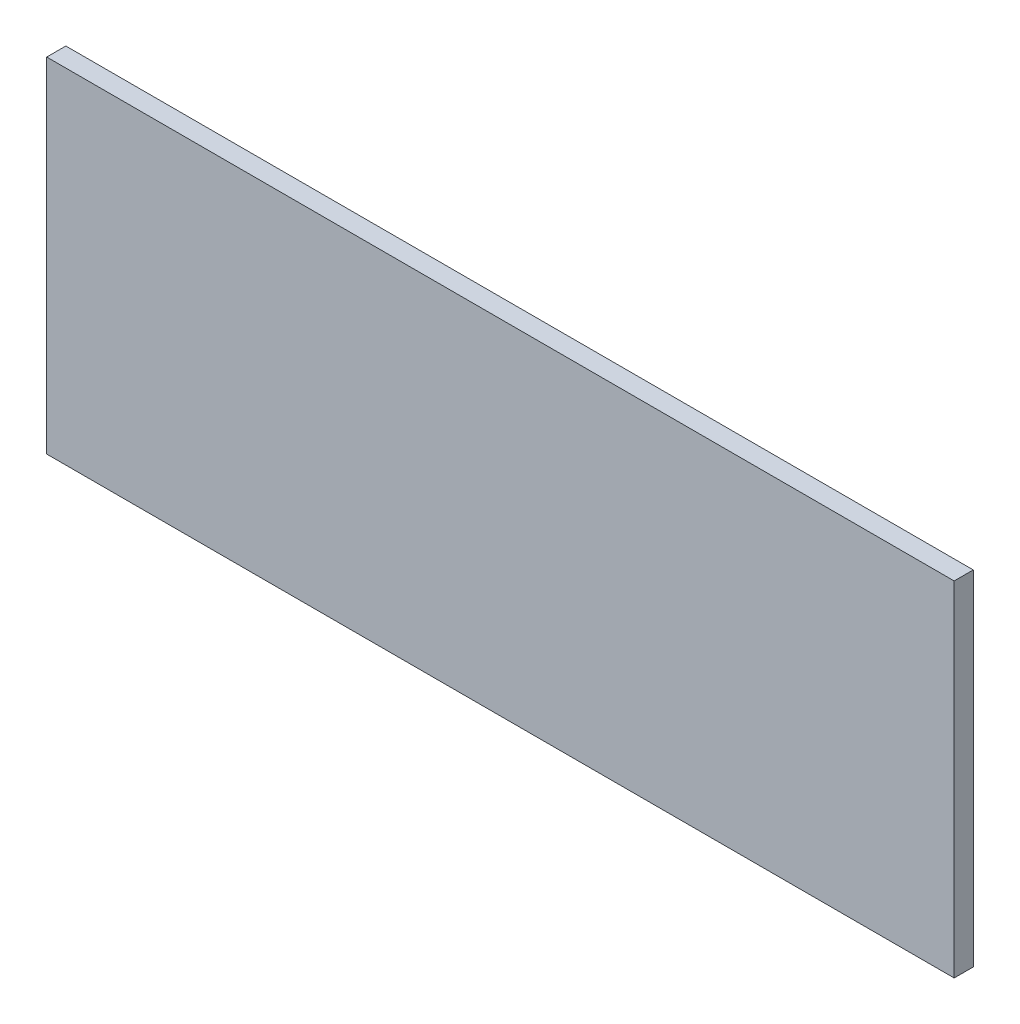
ISO-10303-21;
HEADER;
FILE_DESCRIPTION(('STEP AP214'),'2;1');
FILE_NAME('part.step','',(''),(''),'','','');
FILE_SCHEMA(('AUTOMOTIVE_DESIGN { 1 0 10303 214 1 1 1 1 }'));
ENDSEC;
DATA;
#1=APPLICATION_CONTEXT('core data for automotive mechanical design processes');
#2=APPLICATION_PROTOCOL_DEFINITION('international standard','automotive_design',2000,#1);
#3=PRODUCT_CONTEXT('',#1,'mechanical');
#4=PRODUCT('Part','Part','',(#3));
#5=PRODUCT_RELATED_PRODUCT_CATEGORY('part','',(#4));
#6=PRODUCT_DEFINITION_FORMATION('','',#4);
#7=PRODUCT_DEFINITION_CONTEXT('part definition',#1,'design');
#8=PRODUCT_DEFINITION('design','',#6,#7);
#9=PRODUCT_DEFINITION_SHAPE('','',#8);
#10=(LENGTH_UNIT() NAMED_UNIT(*) SI_UNIT(.MILLI.,.METRE.));
#11=(NAMED_UNIT(*) PLANE_ANGLE_UNIT() SI_UNIT($,.RADIAN.));
#12=(NAMED_UNIT(*) SI_UNIT($,.STERADIAN.) SOLID_ANGLE_UNIT());
#13=UNCERTAINTY_MEASURE_WITH_UNIT(LENGTH_MEASURE(1.E-05),#10,'distance_accuracy_value','');
#14=(GEOMETRIC_REPRESENTATION_CONTEXT(3) GLOBAL_UNCERTAINTY_ASSIGNED_CONTEXT((#13)) GLOBAL_UNIT_ASSIGNED_CONTEXT((#10,
#11,#12)) REPRESENTATION_CONTEXT('',''));
#15=CARTESIAN_POINT('',(0.,0.,0.));
#16=DIRECTION('',(0.,0.,1.));
#17=DIRECTION('',(1.,0.,0.));
#18=AXIS2_PLACEMENT_3D('',#15,#16,#17);
#19=CARTESIAN_POINT('',(-237.5,90.,10.));
#20=DIRECTION('',(1.,0.,0.));
#21=DIRECTION('',(0.,1.,0.));
#22=AXIS2_PLACEMENT_3D('',#19,#20,#21);
#23=PLANE('',#22);
#24=DIRECTION('',(0.,-1.,0.));
#25=VECTOR('',#24,1.);
#26=CARTESIAN_POINT('',(-237.5,90.,0.));
#27=LINE('',#26,#25);
#28=CARTESIAN_POINT('',(-237.5,90.,0.));
#29=VERTEX_POINT('',#28);
#30=CARTESIAN_POINT('',(-237.5,-90.,0.));
#31=VERTEX_POINT('',#30);
#32=EDGE_CURVE('E96',#29,#31,#27,.T.);
#33=ORIENTED_EDGE('',*,*,#32,.T.);
#34=DIRECTION('',(0.,0.,-1.));
#35=VECTOR('',#34,1.);
#36=CARTESIAN_POINT('',(-237.5,-90.,10.));
#37=LINE('',#36,#35);
#38=CARTESIAN_POINT('',(-237.5,-90.,10.));
#39=VERTEX_POINT('',#38);
#40=EDGE_CURVE('E11',#39,#31,#37,.T.);
#41=ORIENTED_EDGE('',*,*,#40,.F.);
#42=DIRECTION('',(0.,-1.,0.));
#43=VECTOR('',#42,1.);
#44=CARTESIAN_POINT('',(-237.5,90.,10.));
#45=LINE('',#44,#43);
#46=CARTESIAN_POINT('',(-237.5,90.,10.));
#47=VERTEX_POINT('',#46);
#48=EDGE_CURVE('E84',#47,#39,#45,.T.);
#49=ORIENTED_EDGE('',*,*,#48,.F.);
#50=DIRECTION('',(0.,0.,-1.));
#51=VECTOR('',#50,1.);
#52=CARTESIAN_POINT('',(-237.5,90.,10.));
#53=LINE('',#52,#51);
#54=EDGE_CURVE('E92',#47,#29,#53,.T.);
#55=ORIENTED_EDGE('',*,*,#54,.T.);
#56=EDGE_LOOP('',(#33,#41,#49,#55));
#57=FACE_BOUND('',#56,.T.);
#58=ADVANCED_FACE('F33',(#57),#23,.F.);
#59=CARTESIAN_POINT('',(237.5,-90.,10.));
#60=DIRECTION('',(0.,1.,0.));
#61=DIRECTION('',(-1.,0.,0.));
#62=AXIS2_PLACEMENT_3D('',#59,#60,#61);
#63=PLANE('',#62);
#64=DIRECTION('',(1.,0.,0.));
#65=VECTOR('',#64,1.);
#66=CARTESIAN_POINT('',(237.5,-90.,0.));
#67=LINE('',#66,#65);
#68=CARTESIAN_POINT('',(237.5,-90.,0.));
#69=VERTEX_POINT('',#68);
#70=EDGE_CURVE('E88',#31,#69,#67,.T.);
#71=ORIENTED_EDGE('',*,*,#70,.T.);
#72=DIRECTION('',(0.,0.,-1.));
#73=VECTOR('',#72,1.);
#74=CARTESIAN_POINT('',(237.5,-90.,10.));
#75=LINE('',#74,#73);
#76=CARTESIAN_POINT('',(237.5,-90.,10.));
#77=VERTEX_POINT('',#76);
#78=EDGE_CURVE('E41',#77,#69,#75,.T.);
#79=ORIENTED_EDGE('',*,*,#78,.F.);
#80=DIRECTION('',(1.,0.,0.));
#81=VECTOR('',#80,1.);
#82=CARTESIAN_POINT('',(237.5,-90.,10.));
#83=LINE('',#82,#81);
#84=EDGE_CURVE('E79',#39,#77,#83,.T.);
#85=ORIENTED_EDGE('',*,*,#84,.F.);
#86=ORIENTED_EDGE('',*,*,#40,.T.);
#87=EDGE_LOOP('',(#71,#79,#85,#86));
#88=FACE_BOUND('',#87,.T.);
#89=ADVANCED_FACE('F87',(#88),#63,.F.);
#90=CARTESIAN_POINT('',(237.5,90.,10.));
#91=DIRECTION('',(-1.,0.,0.));
#92=DIRECTION('',(0.,-1.,0.));
#93=AXIS2_PLACEMENT_3D('',#90,#91,#92);
#94=PLANE('',#93);
#95=DIRECTION('',(0.,1.,0.));
#96=VECTOR('',#95,1.);
#97=CARTESIAN_POINT('',(237.5,90.,0.));
#98=LINE('',#97,#96);
#99=CARTESIAN_POINT('',(237.5,90.,0.));
#100=VERTEX_POINT('',#99);
#101=EDGE_CURVE('E66',#69,#100,#98,.T.);
#102=ORIENTED_EDGE('',*,*,#101,.T.);
#103=DIRECTION('',(0.,0.,-1.));
#104=VECTOR('',#103,1.);
#105=CARTESIAN_POINT('',(237.5,90.,10.));
#106=LINE('',#105,#104);
#107=CARTESIAN_POINT('',(237.5,90.,10.));
#108=VERTEX_POINT('',#107);
#109=EDGE_CURVE('E89',#108,#100,#106,.T.);
#110=ORIENTED_EDGE('',*,*,#109,.F.);
#111=DIRECTION('',(0.,1.,0.));
#112=VECTOR('',#111,1.);
#113=CARTESIAN_POINT('',(237.5,90.,10.));
#114=LINE('',#113,#112);
#115=EDGE_CURVE('E82',#77,#108,#114,.T.);
#116=ORIENTED_EDGE('',*,*,#115,.F.);
#117=ORIENTED_EDGE('',*,*,#78,.T.);
#118=EDGE_LOOP('',(#102,#110,#116,#117));
#119=FACE_BOUND('',#118,.T.);
#120=ADVANCED_FACE('F90',(#119),#94,.F.);
#121=CARTESIAN_POINT('',(237.5,90.,10.));
#122=DIRECTION('',(0.,-1.,0.));
#123=DIRECTION('',(1.,0.,0.));
#124=AXIS2_PLACEMENT_3D('',#121,#122,#123);
#125=PLANE('',#124);
#126=DIRECTION('',(-1.,0.,0.));
#127=VECTOR('',#126,1.);
#128=CARTESIAN_POINT('',(237.5,90.,0.));
#129=LINE('',#128,#127);
#130=EDGE_CURVE('E72',#100,#29,#129,.T.);
#131=ORIENTED_EDGE('',*,*,#130,.T.);
#132=ORIENTED_EDGE('',*,*,#54,.F.);
#133=DIRECTION('',(-1.,0.,0.));
#134=VECTOR('',#133,1.);
#135=CARTESIAN_POINT('',(237.5,90.,10.));
#136=LINE('',#135,#134);
#137=EDGE_CURVE('E49',#108,#47,#136,.T.);
#138=ORIENTED_EDGE('',*,*,#137,.F.);
#139=ORIENTED_EDGE('',*,*,#109,.T.);
#140=EDGE_LOOP('',(#131,#132,#138,#139));
#141=FACE_BOUND('',#140,.T.);
#142=ADVANCED_FACE('F103',(#141),#125,.F.);
#143=CARTESIAN_POINT('',(0.,0.,10.));
#144=DIRECTION('',(0.,0.,-1.));
#145=DIRECTION('',(-1.,0.,0.));
#146=AXIS2_PLACEMENT_3D('',#143,#144,#145);
#147=PLANE('',#146);
#148=ORIENTED_EDGE('',*,*,#48,.T.);
#149=ORIENTED_EDGE('',*,*,#84,.T.);
#150=ORIENTED_EDGE('',*,*,#115,.T.);
#151=ORIENTED_EDGE('',*,*,#137,.T.);
#152=EDGE_LOOP('',(#148,#149,#150,#151));
#153=FACE_BOUND('',#152,.T.);
#154=ADVANCED_FACE('F80',(#153),#147,.F.);
#155=CARTESIAN_POINT('',(0.,0.,0.));
#156=DIRECTION('',(0.,0.,-1.));
#157=DIRECTION('',(-1.,0.,0.));
#158=AXIS2_PLACEMENT_3D('',#155,#156,#157);
#159=PLANE('',#158);
#160=ORIENTED_EDGE('',*,*,#32,.F.);
#161=ORIENTED_EDGE('',*,*,#130,.F.);
#162=ORIENTED_EDGE('',*,*,#101,.F.);
#163=ORIENTED_EDGE('',*,*,#70,.F.);
#164=EDGE_LOOP('',(#160,#161,#162,#163));
#165=FACE_BOUND('',#164,.T.);
#166=ADVANCED_FACE('F106',(#165),#159,.T.);
#167=CLOSED_SHELL('',(#58,#89,#120,#142,#154,#166));
#168=MANIFOLD_SOLID_BREP('B2',#167);
#169=ADVANCED_BREP_SHAPE_REPRESENTATION('',(#18,#168),#14);
#170=SHAPE_DEFINITION_REPRESENTATION(#9,#169);
ENDSEC;
END-ISO-10303-21;
